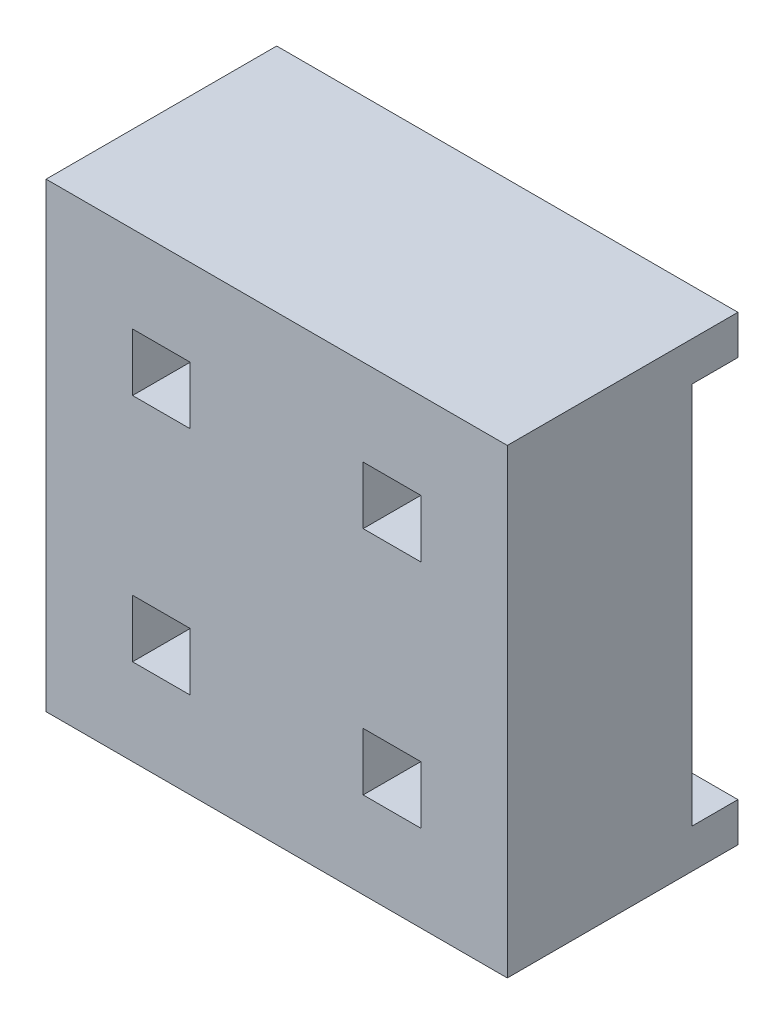
ISO-10303-21;
HEADER;
FILE_DESCRIPTION(('STEP AP214'),'2;1');
FILE_NAME('part.step','',(''),(''),'','','');
FILE_SCHEMA(('AUTOMOTIVE_DESIGN { 1 0 10303 214 1 1 1 1 }'));
ENDSEC;
DATA;
#1=APPLICATION_CONTEXT('core data for automotive mechanical design processes');
#2=APPLICATION_PROTOCOL_DEFINITION('international standard','automotive_design',2000,#1);
#3=PRODUCT_CONTEXT('',#1,'mechanical');
#4=PRODUCT('Part','Part','',(#3));
#5=PRODUCT_RELATED_PRODUCT_CATEGORY('part','',(#4));
#6=PRODUCT_DEFINITION_FORMATION('','',#4);
#7=PRODUCT_DEFINITION_CONTEXT('part definition',#1,'design');
#8=PRODUCT_DEFINITION('design','',#6,#7);
#9=PRODUCT_DEFINITION_SHAPE('','',#8);
#10=(LENGTH_UNIT() NAMED_UNIT(*) SI_UNIT(.MILLI.,.METRE.));
#11=(NAMED_UNIT(*) PLANE_ANGLE_UNIT() SI_UNIT($,.RADIAN.));
#12=(NAMED_UNIT(*) SI_UNIT($,.STERADIAN.) SOLID_ANGLE_UNIT());
#13=UNCERTAINTY_MEASURE_WITH_UNIT(LENGTH_MEASURE(1.E-05),#10,'distance_accuracy_value','');
#14=(GEOMETRIC_REPRESENTATION_CONTEXT(3) GLOBAL_UNCERTAINTY_ASSIGNED_CONTEXT((#13)) GLOBAL_UNIT_ASSIGNED_CONTEXT((#10,
#11,#12)) REPRESENTATION_CONTEXT('',''));
#15=CARTESIAN_POINT('',(0.,0.,0.));
#16=DIRECTION('',(0.,0.,1.));
#17=DIRECTION('',(1.,0.,0.));
#18=AXIS2_PLACEMENT_3D('',#15,#16,#17);
#19=CARTESIAN_POINT('',(0.000124023441458121,0.000124023441458121,1.25));
#20=DIRECTION('',(0.,-4.37113882867379E-08,1.));
#21=DIRECTION('',(0.,-1.,-4.37113882867379E-08));
#22=AXIS2_PLACEMENT_3D('',#19,#20,#21);
#23=PLANE('',#22);
#24=DIRECTION('',(0.,-0.999999999999999,-4.37113882735736E-08));
#25=VECTOR('',#24,1.);
#26=CARTESIAN_POINT('',(-2.53987597655854,-2.10807597655854,1.24999990784765));
#27=LINE('',#26,#25);
#28=CARTESIAN_POINT('',(-2.53987597655854,-2.10807597655854,1.24999990784765));
#29=VERTEX_POINT('',#28);
#30=CARTESIAN_POINT('',(-2.53987597655854,-2.53987597655854,1.24999988897307));
#31=VERTEX_POINT('',#30);
#32=EDGE_CURVE('E11',#29,#31,#27,.T.);
#33=ORIENTED_EDGE('',*,*,#32,.F.);
#34=DIRECTION('',(1.,0.,0.));
#35=VECTOR('',#34,1.);
#36=CARTESIAN_POINT('',(-2.53987597655854,-2.10807597655854,1.24999990784765));
#37=LINE('',#36,#35);
#38=CARTESIAN_POINT('',(2.54012402344146,-2.10807597655854,1.24999990784765));
#39=VERTEX_POINT('',#38);
#40=EDGE_CURVE('E323',#29,#39,#37,.T.);
#41=ORIENTED_EDGE('',*,*,#40,.T.);
#42=DIRECTION('',(0.,0.999999999999999,4.37113882735736E-08));
#43=VECTOR('',#42,1.);
#44=CARTESIAN_POINT('',(2.54012402344146,-2.53987597655854,1.24999988897307));
#45=LINE('',#44,#43);
#46=CARTESIAN_POINT('',(2.54012402344146,-2.53987597655854,1.24999988897307));
#47=VERTEX_POINT('',#46);
#48=EDGE_CURVE('E316',#47,#39,#45,.T.);
#49=ORIENTED_EDGE('',*,*,#48,.F.);
#50=DIRECTION('',(1.,0.,0.));
#51=VECTOR('',#50,1.);
#52=CARTESIAN_POINT('',(-2.53987597655854,-2.53987597655854,1.24999988897307));
#53=LINE('',#52,#51);
#54=EDGE_CURVE('E321',#31,#47,#53,.T.);
#55=ORIENTED_EDGE('',*,*,#54,.F.);
#56=EDGE_LOOP('',(#33,#41,#49,#55));
#57=FACE_BOUND('',#56,.T.);
#58=ADVANCED_FACE('F17',(#57),#23,.F.);
#59=CARTESIAN_POINT('',(-2.53987597655854,2.54012391241453,3.79000011102693));
#60=DIRECTION('',(1.,0.,0.));
#61=DIRECTION('',(0.,1.,4.37113882867379E-08));
#62=AXIS2_PLACEMENT_3D('',#59,#60,#61);
#63=PLANE('',#62);
#64=DIRECTION('',(0.,-0.999999999999999,-4.37113883231379E-08));
#65=VECTOR('',#64,1.);
#66=CARTESIAN_POINT('',(-2.53987597655854,2.10832400123607,1.75800009215235));
#67=LINE('',#66,#65);
#68=CARTESIAN_POINT('',(-2.53987597655854,2.10832400123607,1.75800009215235));
#69=VERTEX_POINT('',#68);
#70=CARTESIAN_POINT('',(-2.53987597655854,-2.10807599876393,1.75799990784765));
#71=VERTEX_POINT('',#70);
#72=EDGE_CURVE('E24',#69,#71,#67,.T.);
#73=ORIENTED_EDGE('',*,*,#72,.T.);
#74=DIRECTION('',(0.,4.37113888392268E-08,-0.999999999999999));
#75=VECTOR('',#74,1.);
#76=CARTESIAN_POINT('',(-2.53987597655854,-2.10807599876393,1.75799990784765));
#77=LINE('',#76,#75);
#78=EDGE_CURVE('E319',#71,#29,#77,.T.);
#79=ORIENTED_EDGE('',*,*,#78,.T.);
#80=ORIENTED_EDGE('',*,*,#32,.T.);
#81=DIRECTION('',(0.,4.3711388314712E-08,-0.999999999999999));
#82=VECTOR('',#81,1.);
#83=CARTESIAN_POINT('',(-2.53987597655854,-2.53987608758547,3.78999988897307));
#84=LINE('',#83,#82);
#85=CARTESIAN_POINT('',(-2.53987597655854,-2.53987608758547,3.78999988897307));
#86=VERTEX_POINT('',#85);
#87=EDGE_CURVE('E301',#86,#31,#84,.T.);
#88=ORIENTED_EDGE('',*,*,#87,.F.);
#89=DIRECTION('',(0.,-0.999999999999999,-4.37113884895503E-08));
#90=VECTOR('',#89,1.);
#91=CARTESIAN_POINT('',(-2.53987597655854,2.54012391241453,3.79000011102693));
#92=LINE('',#91,#90);
#93=CARTESIAN_POINT('',(-2.53987597655854,2.54012391241453,3.79000011102693));
#94=VERTEX_POINT('',#93);
#95=EDGE_CURVE('E289',#94,#86,#92,.T.);
#96=ORIENTED_EDGE('',*,*,#95,.F.);
#97=DIRECTION('',(0.,4.3711388314712E-08,-0.999999999999999));
#98=VECTOR('',#97,1.);
#99=CARTESIAN_POINT('',(-2.53987597655854,2.54012391241453,3.79000011102693));
#100=LINE('',#99,#98);
#101=CARTESIAN_POINT('',(-2.53987597655854,2.54012402344146,1.25000011102693));
#102=VERTEX_POINT('',#101);
#103=EDGE_CURVE('E276',#94,#102,#100,.T.);
#104=ORIENTED_EDGE('',*,*,#103,.T.);
#105=DIRECTION('',(0.,-0.999999999999999,-4.37113882735736E-08));
#106=VECTOR('',#105,1.);
#107=CARTESIAN_POINT('',(-2.53987597655854,2.54012402344146,1.25000011102693));
#108=LINE('',#107,#106);
#109=CARTESIAN_POINT('',(-2.53987597655854,2.10832402344146,1.25000009215235));
#110=VERTEX_POINT('',#109);
#111=EDGE_CURVE('E261',#102,#110,#108,.T.);
#112=ORIENTED_EDGE('',*,*,#111,.T.);
#113=DIRECTION('',(0.,-4.37113879650355E-08,0.999999999999999));
#114=VECTOR('',#113,1.);
#115=CARTESIAN_POINT('',(-2.53987597655854,2.10832402344146,1.25000009215235));
#116=LINE('',#115,#114);
#117=EDGE_CURVE('E247',#110,#69,#116,.T.);
#118=ORIENTED_EDGE('',*,*,#117,.T.);
#119=EDGE_LOOP('',(#73,#79,#80,#88,#96,#104,#112,#118));
#120=FACE_BOUND('',#119,.T.);
#121=ADVANCED_FACE('F416',(#120),#63,.F.);
#122=CARTESIAN_POINT('',(-2.53987597655854,-2.53987608758547,3.78999988897307));
#123=DIRECTION('',(0.,1.,4.37113882867379E-08));
#124=DIRECTION('',(-1.,0.,0.));
#125=AXIS2_PLACEMENT_3D('',#122,#123,#124);
#126=PLANE('',#125);
#127=ORIENTED_EDGE('',*,*,#54,.T.);
#128=DIRECTION('',(0.,4.3711388314712E-08,-0.999999999999999));
#129=VECTOR('',#128,1.);
#130=CARTESIAN_POINT('',(2.54012402344146,-2.53987608758547,3.78999988897307));
#131=LINE('',#130,#129);
#132=CARTESIAN_POINT('',(2.54012402344146,-2.53987608758547,3.78999988897307));
#133=VERTEX_POINT('',#132);
#134=EDGE_CURVE('E313',#133,#47,#131,.T.);
#135=ORIENTED_EDGE('',*,*,#134,.F.);
#136=DIRECTION('',(1.,0.,0.));
#137=VECTOR('',#136,1.);
#138=CARTESIAN_POINT('',(-2.53987597655854,-2.53987608758547,3.78999988897307));
#139=LINE('',#138,#137);
#140=EDGE_CURVE('E304',#86,#133,#139,.T.);
#141=ORIENTED_EDGE('',*,*,#140,.F.);
#142=ORIENTED_EDGE('',*,*,#87,.T.);
#143=EDGE_LOOP('',(#127,#135,#141,#142));
#144=FACE_BOUND('',#143,.T.);
#145=ADVANCED_FACE('F420',(#144),#126,.F.);
#146=CARTESIAN_POINT('',(2.54012402344146,-2.53987608758547,3.78999988897307));
#147=DIRECTION('',(-1.,0.,0.));
#148=DIRECTION('',(0.,-1.,-4.37113882867379E-08));
#149=AXIS2_PLACEMENT_3D('',#146,#147,#148);
#150=PLANE('',#149);
#151=ORIENTED_EDGE('',*,*,#48,.T.);
#152=DIRECTION('',(0.,4.37113888392268E-08,-0.999999999999999));
#153=VECTOR('',#152,1.);
#154=CARTESIAN_POINT('',(2.54012402344146,-2.10807599876393,1.75799990784765));
#155=LINE('',#154,#153);
#156=CARTESIAN_POINT('',(2.54012402344146,-2.10807599876393,1.75799990784765));
#157=VERTEX_POINT('',#156);
#158=EDGE_CURVE('E307',#157,#39,#155,.T.);
#159=ORIENTED_EDGE('',*,*,#158,.F.);
#160=DIRECTION('',(0.,-0.999999999999999,-4.37113883231379E-08));
#161=VECTOR('',#160,1.);
#162=CARTESIAN_POINT('',(2.54012402344146,2.10832400123607,1.75800009215235));
#163=LINE('',#162,#161);
#164=CARTESIAN_POINT('',(2.54012402344146,2.10832400123607,1.75800009215235));
#165=VERTEX_POINT('',#164);
#166=EDGE_CURVE('E292',#165,#157,#163,.T.);
#167=ORIENTED_EDGE('',*,*,#166,.F.);
#168=DIRECTION('',(0.,-4.37113879650355E-08,0.999999999999999));
#169=VECTOR('',#168,1.);
#170=CARTESIAN_POINT('',(2.54012402344146,2.10832402344146,1.25000009215235));
#171=LINE('',#170,#169);
#172=CARTESIAN_POINT('',(2.54012402344146,2.10832402344146,1.25000009215235));
#173=VERTEX_POINT('',#172);
#174=EDGE_CURVE('E278',#173,#165,#171,.T.);
#175=ORIENTED_EDGE('',*,*,#174,.F.);
#176=DIRECTION('',(0.,0.999999999999999,4.37113882735736E-08));
#177=VECTOR('',#176,1.);
#178=CARTESIAN_POINT('',(2.54012402344146,2.10832402344146,1.25000009215235));
#179=LINE('',#178,#177);
#180=CARTESIAN_POINT('',(2.54012402344146,2.54012402344146,1.25000011102693));
#181=VERTEX_POINT('',#180);
#182=EDGE_CURVE('E263',#173,#181,#179,.T.);
#183=ORIENTED_EDGE('',*,*,#182,.T.);
#184=DIRECTION('',(0.,4.3711388314712E-08,-0.999999999999999));
#185=VECTOR('',#184,1.);
#186=CARTESIAN_POINT('',(2.54012402344146,2.54012391241453,3.79000011102693));
#187=LINE('',#186,#185);
#188=CARTESIAN_POINT('',(2.54012402344146,2.54012391241453,3.79000011102693));
#189=VERTEX_POINT('',#188);
#190=EDGE_CURVE('E249',#189,#181,#187,.T.);
#191=ORIENTED_EDGE('',*,*,#190,.F.);
#192=DIRECTION('',(0.,0.999999999999999,4.37113881398737E-08));
#193=VECTOR('',#192,1.);
#194=CARTESIAN_POINT('',(2.54012402344146,-2.53987608758547,3.78999988897307));
#195=LINE('',#194,#193);
#196=EDGE_CURVE('E236',#133,#189,#195,.T.);
#197=ORIENTED_EDGE('',*,*,#196,.F.);
#198=ORIENTED_EDGE('',*,*,#134,.T.);
#199=EDGE_LOOP('',(#151,#159,#167,#175,#183,#191,#197,#198));
#200=FACE_BOUND('',#199,.T.);
#201=ADVANCED_FACE('F329',(#200),#150,.F.);
#202=CARTESIAN_POINT('',(0.952624023441458,1.58762391241453,3.79000006939183));
#203=DIRECTION('',(1.,0.,0.));
#204=DIRECTION('',(0.,1.,4.37113882867379E-08));
#205=AXIS2_PLACEMENT_3D('',#202,#203,#204);
#206=PLANE('',#205);
#207=DIRECTION('',(0.,-0.999999999999999,-4.3711388314712E-08));
#208=VECTOR('',#207,1.);
#209=CARTESIAN_POINT('',(0.952624023441458,1.58762400123607,1.75800006939183));
#210=LINE('',#209,#208);
#211=CARTESIAN_POINT('',(0.952624023441458,1.58762400123607,1.75800006939183));
#212=VERTEX_POINT('',#211);
#213=CARTESIAN_POINT('',(0.952624023441458,0.952624001236073,1.7580000416351));
#214=VERTEX_POINT('',#213);
#215=EDGE_CURVE('E310',#212,#214,#210,.T.);
#216=ORIENTED_EDGE('',*,*,#215,.F.);
#217=DIRECTION('',(0.,4.37113884021311E-08,-0.999999999999999));
#218=VECTOR('',#217,1.);
#219=CARTESIAN_POINT('',(0.952624023441458,1.58762391241453,3.79000006939183));
#220=LINE('',#219,#218);
#221=CARTESIAN_POINT('',(0.952624023441458,1.58762391241453,3.79000006939183));
#222=VERTEX_POINT('',#221);
#223=EDGE_CURVE('E295',#222,#212,#220,.T.);
#224=ORIENTED_EDGE('',*,*,#223,.F.);
#225=DIRECTION('',(0.,-0.999999999999999,-4.3711388314712E-08));
#226=VECTOR('',#225,1.);
#227=CARTESIAN_POINT('',(0.952624023441458,1.58762391241453,3.79000006939183));
#228=LINE('',#227,#226);
#229=CARTESIAN_POINT('',(0.952624023441458,0.952623912414532,3.7900000416351));
#230=VERTEX_POINT('',#229);
#231=EDGE_CURVE('E281',#222,#230,#228,.T.);
#232=ORIENTED_EDGE('',*,*,#231,.T.);
#233=DIRECTION('',(0.,4.37113882928572E-08,-0.999999999999999));
#234=VECTOR('',#233,1.);
#235=CARTESIAN_POINT('',(0.952624023441458,0.952623912414532,3.7900000416351));
#236=LINE('',#235,#234);
#237=EDGE_CURVE('E265',#230,#214,#236,.T.);
#238=ORIENTED_EDGE('',*,*,#237,.T.);
#239=EDGE_LOOP('',(#216,#224,#232,#238));
#240=FACE_BOUND('',#239,.T.);
#241=ADVANCED_FACE('F435',(#240),#206,.T.);
#242=CARTESIAN_POINT('',(1.58762402344146,1.58762391241453,3.79000006939183));
#243=DIRECTION('',(0.,-1.,-4.37113882867379E-08));
#244=DIRECTION('',(1.,0.,0.));
#245=AXIS2_PLACEMENT_3D('',#242,#243,#244);
#246=PLANE('',#245);
#247=DIRECTION('',(-1.,0.,0.));
#248=VECTOR('',#247,1.);
#249=CARTESIAN_POINT('',(1.58762402344146,1.58762400123607,1.75800006939183));
#250=LINE('',#249,#248);
#251=CARTESIAN_POINT('',(1.58762402344146,1.58762400123607,1.75800006939183));
#252=VERTEX_POINT('',#251);
#253=EDGE_CURVE('E298',#252,#212,#250,.T.);
#254=ORIENTED_EDGE('',*,*,#253,.F.);
#255=DIRECTION('',(0.,4.37113884021311E-08,-0.999999999999999));
#256=VECTOR('',#255,1.);
#257=CARTESIAN_POINT('',(1.58762402344146,1.58762391241453,3.79000006939183));
#258=LINE('',#257,#256);
#259=CARTESIAN_POINT('',(1.58762402344146,1.58762391241453,3.79000006939183));
#260=VERTEX_POINT('',#259);
#261=EDGE_CURVE('E283',#260,#252,#258,.T.);
#262=ORIENTED_EDGE('',*,*,#261,.F.);
#263=DIRECTION('',(-1.,0.,0.));
#264=VECTOR('',#263,1.);
#265=CARTESIAN_POINT('',(1.58762402344146,1.58762391241453,3.79000006939183));
#266=LINE('',#265,#264);
#267=EDGE_CURVE('E267',#260,#222,#266,.T.);
#268=ORIENTED_EDGE('',*,*,#267,.T.);
#269=ORIENTED_EDGE('',*,*,#223,.T.);
#270=EDGE_LOOP('',(#254,#262,#268,#269));
#271=FACE_BOUND('',#270,.T.);
#272=ADVANCED_FACE('F438',(#271),#246,.T.);
#273=CARTESIAN_POINT('',(1.58762402344146,0.952623912414532,3.7900000416351));
#274=DIRECTION('',(-1.,0.,0.));
#275=DIRECTION('',(0.,-1.,-4.37113882867379E-08));
#276=AXIS2_PLACEMENT_3D('',#273,#274,#275);
#277=PLANE('',#276);
#278=DIRECTION('',(0.,0.999999999999999,4.3711388314712E-08));
#279=VECTOR('',#278,1.);
#280=CARTESIAN_POINT('',(1.58762402344146,0.952624001236073,1.7580000416351));
#281=LINE('',#280,#279);
#282=CARTESIAN_POINT('',(1.58762402344146,0.952624001236073,1.7580000416351));
#283=VERTEX_POINT('',#282);
#284=EDGE_CURVE('E286',#283,#252,#281,.T.);
#285=ORIENTED_EDGE('',*,*,#284,.F.);
#286=DIRECTION('',(0.,4.37113882928572E-08,-0.999999999999999));
#287=VECTOR('',#286,1.);
#288=CARTESIAN_POINT('',(1.58762402344146,0.952623912414532,3.7900000416351));
#289=LINE('',#288,#287);
#290=CARTESIAN_POINT('',(1.58762402344146,0.952623912414532,3.7900000416351));
#291=VERTEX_POINT('',#290);
#292=EDGE_CURVE('E270',#291,#283,#289,.T.);
#293=ORIENTED_EDGE('',*,*,#292,.F.);
#294=DIRECTION('',(0.,0.999999999999999,4.3711388314712E-08));
#295=VECTOR('',#294,1.);
#296=CARTESIAN_POINT('',(1.58762402344146,0.952623912414532,3.7900000416351));
#297=LINE('',#296,#295);
#298=EDGE_CURVE('E252',#291,#260,#297,.T.);
#299=ORIENTED_EDGE('',*,*,#298,.T.);
#300=ORIENTED_EDGE('',*,*,#261,.T.);
#301=EDGE_LOOP('',(#285,#293,#299,#300));
#302=FACE_BOUND('',#301,.T.);
#303=ADVANCED_FACE('F442',(#302),#277,.T.);
#304=CARTESIAN_POINT('',(0.952624023441458,-0.952376087585468,3.7899999583649));
#305=DIRECTION('',(1.,0.,0.));
#306=DIRECTION('',(0.,1.,4.37113882867379E-08));
#307=AXIS2_PLACEMENT_3D('',#304,#305,#306);
#308=PLANE('',#307);
#309=DIRECTION('',(0.,-0.999999999999999,-4.3711388314712E-08));
#310=VECTOR('',#309,1.);
#311=CARTESIAN_POINT('',(0.952624023441458,-0.952375998763927,1.7579999583649));
#312=LINE('',#311,#310);
#313=CARTESIAN_POINT('',(0.952624023441458,-0.952375998763927,1.7579999583649));
#314=VERTEX_POINT('',#313);
#315=CARTESIAN_POINT('',(0.952624023441458,-1.58737599876393,1.75799993060817));
#316=VERTEX_POINT('',#315);
#317=EDGE_CURVE('E273',#314,#316,#312,.T.);
#318=ORIENTED_EDGE('',*,*,#317,.F.);
#319=DIRECTION('',(0.,4.37113882928572E-08,-0.999999999999999));
#320=VECTOR('',#319,1.);
#321=CARTESIAN_POINT('',(0.952624023441458,-0.952376087585468,3.7899999583649));
#322=LINE('',#321,#320);
#323=CARTESIAN_POINT('',(0.952624023441458,-0.952376087585468,3.7899999583649));
#324=VERTEX_POINT('',#323);
#325=EDGE_CURVE('E255',#324,#314,#322,.T.);
#326=ORIENTED_EDGE('',*,*,#325,.F.);
#327=DIRECTION('',(0.,-0.999999999999999,-4.3711388314712E-08));
#328=VECTOR('',#327,1.);
#329=CARTESIAN_POINT('',(0.952624023441458,-0.952376087585468,3.7899999583649));
#330=LINE('',#329,#328);
#331=CARTESIAN_POINT('',(0.952624023441458,-1.58737608758547,3.78999993060817));
#332=VERTEX_POINT('',#331);
#333=EDGE_CURVE('E239',#324,#332,#330,.T.);
#334=ORIENTED_EDGE('',*,*,#333,.T.);
#335=DIRECTION('',(0.,4.37113881835833E-08,-0.999999999999999));
#336=VECTOR('',#335,1.);
#337=CARTESIAN_POINT('',(0.952624023441458,-1.58737608758547,3.78999993060817));
#338=LINE('',#337,#336);
#339=EDGE_CURVE('E225',#332,#316,#338,.T.);
#340=ORIENTED_EDGE('',*,*,#339,.T.);
#341=EDGE_LOOP('',(#318,#326,#334,#340));
#342=FACE_BOUND('',#341,.T.);
#343=ADVANCED_FACE('F450',(#342),#308,.T.);
#344=CARTESIAN_POINT('',(1.58762402344146,-0.952376087585468,3.7899999583649));
#345=DIRECTION('',(0.,-1.,-4.37113882867379E-08));
#346=DIRECTION('',(1.,0.,0.));
#347=AXIS2_PLACEMENT_3D('',#344,#345,#346);
#348=PLANE('',#347);
#349=DIRECTION('',(-1.,0.,0.));
#350=VECTOR('',#349,1.);
#351=CARTESIAN_POINT('',(1.58762402344146,-0.952375998763927,1.7579999583649));
#352=LINE('',#351,#350);
#353=CARTESIAN_POINT('',(1.58762402344146,-0.952375998763927,1.7579999583649));
#354=VERTEX_POINT('',#353);
#355=EDGE_CURVE('E258',#354,#314,#352,.T.);
#356=ORIENTED_EDGE('',*,*,#355,.F.);
#357=DIRECTION('',(0.,4.37113882928572E-08,-0.999999999999999));
#358=VECTOR('',#357,1.);
#359=CARTESIAN_POINT('',(1.58762402344146,-0.952376087585468,3.7899999583649));
#360=LINE('',#359,#358);
#361=CARTESIAN_POINT('',(1.58762402344146,-0.952376087585468,3.7899999583649));
#362=VERTEX_POINT('',#361);
#363=EDGE_CURVE('E241',#362,#354,#360,.T.);
#364=ORIENTED_EDGE('',*,*,#363,.F.);
#365=DIRECTION('',(-1.,0.,0.));
#366=VECTOR('',#365,1.);
#367=CARTESIAN_POINT('',(1.58762402344146,-0.952376087585468,3.7899999583649));
#368=LINE('',#367,#366);
#369=EDGE_CURVE('E227',#362,#324,#368,.T.);
#370=ORIENTED_EDGE('',*,*,#369,.T.);
#371=ORIENTED_EDGE('',*,*,#325,.T.);
#372=EDGE_LOOP('',(#356,#364,#370,#371));
#373=FACE_BOUND('',#372,.T.);
#374=ADVANCED_FACE('F454',(#373),#348,.T.);
#375=CARTESIAN_POINT('',(1.58762402344146,-1.58737608758547,3.78999993060817));
#376=DIRECTION('',(-1.,0.,0.));
#377=DIRECTION('',(0.,-1.,-4.37113882867379E-08));
#378=AXIS2_PLACEMENT_3D('',#375,#376,#377);
#379=PLANE('',#378);
#380=DIRECTION('',(0.,0.999999999999999,4.3711388314712E-08));
#381=VECTOR('',#380,1.);
#382=CARTESIAN_POINT('',(1.58762402344146,-1.58737599876393,1.75799993060817));
#383=LINE('',#382,#381);
#384=CARTESIAN_POINT('',(1.58762402344146,-1.58737599876393,1.75799993060817));
#385=VERTEX_POINT('',#384);
#386=EDGE_CURVE('E244',#385,#354,#383,.T.);
#387=ORIENTED_EDGE('',*,*,#386,.F.);
#388=DIRECTION('',(0.,4.37113881835833E-08,-0.999999999999999));
#389=VECTOR('',#388,1.);
#390=CARTESIAN_POINT('',(1.58762402344146,-1.58737608758547,3.78999993060817));
#391=LINE('',#390,#389);
#392=CARTESIAN_POINT('',(1.58762402344146,-1.58737608758547,3.78999993060817));
#393=VERTEX_POINT('',#392);
#394=EDGE_CURVE('E230',#393,#385,#391,.T.);
#395=ORIENTED_EDGE('',*,*,#394,.F.);
#396=DIRECTION('',(0.,0.999999999999999,4.3711388314712E-08));
#397=VECTOR('',#396,1.);
#398=CARTESIAN_POINT('',(1.58762402344146,-1.58737608758547,3.78999993060817));
#399=LINE('',#398,#397);
#400=EDGE_CURVE('E216',#393,#362,#399,.T.);
#401=ORIENTED_EDGE('',*,*,#400,.T.);
#402=ORIENTED_EDGE('',*,*,#363,.T.);
#403=EDGE_LOOP('',(#387,#395,#401,#402));
#404=FACE_BOUND('',#403,.T.);
#405=ADVANCED_FACE('F464',(#404),#379,.T.);
#406=CARTESIAN_POINT('',(-1.58737597655854,1.58762391241453,3.79000006939183));
#407=DIRECTION('',(1.,0.,0.));
#408=DIRECTION('',(0.,1.,4.37113882867379E-08));
#409=AXIS2_PLACEMENT_3D('',#406,#407,#408);
#410=PLANE('',#409);
#411=DIRECTION('',(0.,-0.999999999999999,-4.3711388314712E-08));
#412=VECTOR('',#411,1.);
#413=CARTESIAN_POINT('',(-1.58737597655854,1.58762400123607,1.75800006939183));
#414=LINE('',#413,#412);
#415=CARTESIAN_POINT('',(-1.58737597655854,1.58762400123607,1.75800006939183));
#416=VERTEX_POINT('',#415);
#417=CARTESIAN_POINT('',(-1.58737597655854,0.952624001236073,1.7580000416351));
#418=VERTEX_POINT('',#417);
#419=EDGE_CURVE('E233',#416,#418,#414,.T.);
#420=ORIENTED_EDGE('',*,*,#419,.F.);
#421=DIRECTION('',(0.,4.37113884021311E-08,-0.999999999999999));
#422=VECTOR('',#421,1.);
#423=CARTESIAN_POINT('',(-1.58737597655854,1.58762391241453,3.79000006939183));
#424=LINE('',#423,#422);
#425=CARTESIAN_POINT('',(-1.58737597655854,1.58762391241453,3.79000006939183));
#426=VERTEX_POINT('',#425);
#427=EDGE_CURVE('E219',#426,#416,#424,.T.);
#428=ORIENTED_EDGE('',*,*,#427,.F.);
#429=DIRECTION('',(0.,-0.999999999999999,-4.3711388314712E-08));
#430=VECTOR('',#429,1.);
#431=CARTESIAN_POINT('',(-1.58737597655854,1.58762391241453,3.79000006939183));
#432=LINE('',#431,#430);
#433=CARTESIAN_POINT('',(-1.58737597655854,0.952623912414532,3.7900000416351));
#434=VERTEX_POINT('',#433);
#435=EDGE_CURVE('E201',#426,#434,#432,.T.);
#436=ORIENTED_EDGE('',*,*,#435,.T.);
#437=DIRECTION('',(0.,4.37113882928572E-08,-0.999999999999999));
#438=VECTOR('',#437,1.);
#439=CARTESIAN_POINT('',(-1.58737597655854,0.952623912414532,3.7900000416351));
#440=LINE('',#439,#438);
#441=EDGE_CURVE('E384',#434,#418,#440,.T.);
#442=ORIENTED_EDGE('',*,*,#441,.T.);
#443=EDGE_LOOP('',(#420,#428,#436,#442));
#444=FACE_BOUND('',#443,.T.);
#445=ADVANCED_FACE('F397',(#444),#410,.T.);
#446=CARTESIAN_POINT('',(-0.952375976558542,1.58762391241453,3.79000006939183));
#447=DIRECTION('',(0.,-1.,-4.37113882867379E-08));
#448=DIRECTION('',(1.,0.,0.));
#449=AXIS2_PLACEMENT_3D('',#446,#447,#448);
#450=PLANE('',#449);
#451=DIRECTION('',(-1.,0.,0.));
#452=VECTOR('',#451,1.);
#453=CARTESIAN_POINT('',(-0.952375976558542,1.58762400123607,1.75800006939183));
#454=LINE('',#453,#452);
#455=CARTESIAN_POINT('',(-0.952375976558542,1.58762400123607,1.75800006939183));
#456=VERTEX_POINT('',#455);
#457=EDGE_CURVE('E222',#456,#416,#454,.T.);
#458=ORIENTED_EDGE('',*,*,#457,.F.);
#459=DIRECTION('',(0.,4.37113884021311E-08,-0.999999999999999));
#460=VECTOR('',#459,1.);
#461=CARTESIAN_POINT('',(-0.952375976558542,1.58762391241453,3.79000006939183));
#462=LINE('',#461,#460);
#463=CARTESIAN_POINT('',(-0.952375976558542,1.58762391241453,3.79000006939183));
#464=VERTEX_POINT('',#463);
#465=EDGE_CURVE('E204',#464,#456,#462,.T.);
#466=ORIENTED_EDGE('',*,*,#465,.F.);
#467=DIRECTION('',(-1.,0.,0.));
#468=VECTOR('',#467,1.);
#469=CARTESIAN_POINT('',(-0.952375976558542,1.58762391241453,3.79000006939183));
#470=LINE('',#469,#468);
#471=EDGE_CURVE('E207',#464,#426,#470,.T.);
#472=ORIENTED_EDGE('',*,*,#471,.T.);
#473=ORIENTED_EDGE('',*,*,#427,.T.);
#474=EDGE_LOOP('',(#458,#466,#472,#473));
#475=FACE_BOUND('',#474,.T.);
#476=ADVANCED_FACE('F389',(#475),#450,.T.);
#477=CARTESIAN_POINT('',(-0.952375976558542,0.952623912414532,3.7900000416351));
#478=DIRECTION('',(-1.,0.,0.));
#479=DIRECTION('',(0.,-1.,-4.37113882867379E-08));
#480=AXIS2_PLACEMENT_3D('',#477,#478,#479);
#481=PLANE('',#480);
#482=DIRECTION('',(0.,0.999999999999999,4.3711388314712E-08));
#483=VECTOR('',#482,1.);
#484=CARTESIAN_POINT('',(-0.952375976558542,0.952624001236073,1.7580000416351));
#485=LINE('',#484,#483);
#486=CARTESIAN_POINT('',(-0.952375976558542,0.952624001236073,1.7580000416351));
#487=VERTEX_POINT('',#486);
#488=EDGE_CURVE('E213',#487,#456,#485,.T.);
#489=ORIENTED_EDGE('',*,*,#488,.F.);
#490=DIRECTION('',(0.,4.37113882928572E-08,-0.999999999999999));
#491=VECTOR('',#490,1.);
#492=CARTESIAN_POINT('',(-0.952375976558542,0.952623912414532,3.7900000416351));
#493=LINE('',#492,#491);
#494=CARTESIAN_POINT('',(-0.952375976558542,0.952623912414532,3.7900000416351));
#495=VERTEX_POINT('',#494);
#496=EDGE_CURVE('E202',#495,#487,#493,.T.);
#497=ORIENTED_EDGE('',*,*,#496,.F.);
#498=DIRECTION('',(0.,0.999999999999999,4.3711388314712E-08));
#499=VECTOR('',#498,1.);
#500=CARTESIAN_POINT('',(-0.952375976558542,0.952623912414532,3.7900000416351));
#501=LINE('',#500,#499);
#502=EDGE_CURVE('E378',#495,#464,#501,.T.);
#503=ORIENTED_EDGE('',*,*,#502,.T.);
#504=ORIENTED_EDGE('',*,*,#465,.T.);
#505=EDGE_LOOP('',(#489,#497,#503,#504));
#506=FACE_BOUND('',#505,.T.);
#507=ADVANCED_FACE('F403',(#506),#481,.T.);
#508=CARTESIAN_POINT('',(-1.58737597655854,-0.952376087585468,3.7899999583649));
#509=DIRECTION('',(1.,0.,0.));
#510=DIRECTION('',(0.,1.,4.37113882867379E-08));
#511=AXIS2_PLACEMENT_3D('',#508,#509,#510);
#512=PLANE('',#511);
#513=DIRECTION('',(0.,-0.999999999999999,-4.3711388314712E-08));
#514=VECTOR('',#513,1.);
#515=CARTESIAN_POINT('',(-1.58737597655854,-0.952375998763927,1.7579999583649));
#516=LINE('',#515,#514);
#517=CARTESIAN_POINT('',(-1.58737597655854,-0.952375998763927,1.7579999583649));
#518=VERTEX_POINT('',#517);
#519=CARTESIAN_POINT('',(-1.58737597655854,-1.58737599876393,1.75799993060817));
#520=VERTEX_POINT('',#519);
#521=EDGE_CURVE('E177',#518,#520,#516,.T.);
#522=ORIENTED_EDGE('',*,*,#521,.F.);
#523=DIRECTION('',(0.,4.37113882928572E-08,-0.999999999999999));
#524=VECTOR('',#523,1.);
#525=CARTESIAN_POINT('',(-1.58737597655854,-0.952376087585468,3.7899999583649));
#526=LINE('',#525,#524);
#527=CARTESIAN_POINT('',(-1.58737597655854,-0.952376087585468,3.7899999583649));
#528=VERTEX_POINT('',#527);
#529=EDGE_CURVE('E381',#528,#518,#526,.T.);
#530=ORIENTED_EDGE('',*,*,#529,.F.);
#531=DIRECTION('',(0.,-0.999999999999999,-4.3711388314712E-08));
#532=VECTOR('',#531,1.);
#533=CARTESIAN_POINT('',(-1.58737597655854,-0.952376087585468,3.7899999583649));
#534=LINE('',#533,#532);
#535=CARTESIAN_POINT('',(-1.58737597655854,-1.58737608758547,3.78999993060817));
#536=VERTEX_POINT('',#535);
#537=EDGE_CURVE('E180',#528,#536,#534,.T.);
#538=ORIENTED_EDGE('',*,*,#537,.T.);
#539=DIRECTION('',(0.,4.37113881835833E-08,-0.999999999999999));
#540=VECTOR('',#539,1.);
#541=CARTESIAN_POINT('',(-1.58737597655854,-1.58737608758547,3.78999993060817));
#542=LINE('',#541,#540);
#543=EDGE_CURVE('E173',#536,#520,#542,.T.);
#544=ORIENTED_EDGE('',*,*,#543,.T.);
#545=EDGE_LOOP('',(#522,#530,#538,#544));
#546=FACE_BOUND('',#545,.T.);
#547=ADVANCED_FACE('F175',(#546),#512,.T.);
#548=CARTESIAN_POINT('',(-0.952375976558542,-0.952376087585468,3.7899999583649));
#549=DIRECTION('',(0.,-1.,-4.37113882867379E-08));
#550=DIRECTION('',(1.,0.,0.));
#551=AXIS2_PLACEMENT_3D('',#548,#549,#550);
#552=PLANE('',#551);
#553=DIRECTION('',(-1.,0.,0.));
#554=VECTOR('',#553,1.);
#555=CARTESIAN_POINT('',(-0.952375976558542,-0.952375998763927,1.7579999583649));
#556=LINE('',#555,#554);
#557=CARTESIAN_POINT('',(-0.952375976558542,-0.952375998763927,1.7579999583649));
#558=VERTEX_POINT('',#557);
#559=EDGE_CURVE('E200',#558,#518,#556,.T.);
#560=ORIENTED_EDGE('',*,*,#559,.F.);
#561=DIRECTION('',(0.,4.37113882928572E-08,-0.999999999999999));
#562=VECTOR('',#561,1.);
#563=CARTESIAN_POINT('',(-0.952375976558542,-0.952376087585468,3.7899999583649));
#564=LINE('',#563,#562);
#565=CARTESIAN_POINT('',(-0.952375976558542,-0.952376087585468,3.7899999583649));
#566=VERTEX_POINT('',#565);
#567=EDGE_CURVE('E373',#566,#558,#564,.T.);
#568=ORIENTED_EDGE('',*,*,#567,.F.);
#569=DIRECTION('',(-1.,0.,0.));
#570=VECTOR('',#569,1.);
#571=CARTESIAN_POINT('',(-0.952375976558542,-0.952376087585468,3.7899999583649));
#572=LINE('',#571,#570);
#573=EDGE_CURVE('E184',#566,#528,#572,.T.);
#574=ORIENTED_EDGE('',*,*,#573,.T.);
#575=ORIENTED_EDGE('',*,*,#529,.T.);
#576=EDGE_LOOP('',(#560,#568,#574,#575));
#577=FACE_BOUND('',#576,.T.);
#578=ADVANCED_FACE('F411',(#577),#552,.T.);
#579=CARTESIAN_POINT('',(-0.952375976558542,-1.58737608758547,3.78999993060817));
#580=DIRECTION('',(-1.,0.,0.));
#581=DIRECTION('',(0.,-1.,-4.37113882867379E-08));
#582=AXIS2_PLACEMENT_3D('',#579,#580,#581);
#583=PLANE('',#582);
#584=DIRECTION('',(0.,0.999999999999999,4.3711388314712E-08));
#585=VECTOR('',#584,1.);
#586=CARTESIAN_POINT('',(-0.952375976558542,-1.58737599876393,1.75799993060817));
#587=LINE('',#586,#585);
#588=CARTESIAN_POINT('',(-0.952375976558542,-1.58737599876393,1.75799993060817));
#589=VERTEX_POINT('',#588);
#590=EDGE_CURVE('E376',#589,#558,#587,.T.);
#591=ORIENTED_EDGE('',*,*,#590,.F.);
#592=DIRECTION('',(0.,4.37113881835833E-08,-0.999999999999999));
#593=VECTOR('',#592,1.);
#594=CARTESIAN_POINT('',(-0.952375976558542,-1.58737608758547,3.78999993060817));
#595=LINE('',#594,#593);
#596=CARTESIAN_POINT('',(-0.952375976558542,-1.58737608758547,3.78999993060817));
#597=VERTEX_POINT('',#596);
#598=EDGE_CURVE('E191',#597,#589,#595,.T.);
#599=ORIENTED_EDGE('',*,*,#598,.F.);
#600=DIRECTION('',(0.,0.999999999999999,4.3711388314712E-08));
#601=VECTOR('',#600,1.);
#602=CARTESIAN_POINT('',(-0.952375976558542,-1.58737608758547,3.78999993060817));
#603=LINE('',#602,#601);
#604=EDGE_CURVE('E361',#597,#566,#603,.T.);
#605=ORIENTED_EDGE('',*,*,#604,.T.);
#606=ORIENTED_EDGE('',*,*,#567,.T.);
#607=EDGE_LOOP('',(#591,#599,#605,#606));
#608=FACE_BOUND('',#607,.T.);
#609=ADVANCED_FACE('F470',(#608),#583,.T.);
#610=CARTESIAN_POINT('',(0.952624023441458,0.952623912414532,3.7900000416351));
#611=DIRECTION('',(0.,1.,4.37113882867379E-08));
#612=DIRECTION('',(-1.,0.,0.));
#613=AXIS2_PLACEMENT_3D('',#610,#611,#612);
#614=PLANE('',#613);
#615=DIRECTION('',(1.,0.,0.));
#616=VECTOR('',#615,1.);
#617=CARTESIAN_POINT('',(0.952624023441458,0.952624001236073,1.7580000416351));
#618=LINE('',#617,#616);
#619=EDGE_CURVE('E369',#214,#283,#618,.T.);
#620=ORIENTED_EDGE('',*,*,#619,.F.);
#621=ORIENTED_EDGE('',*,*,#237,.F.);
#622=DIRECTION('',(1.,0.,0.));
#623=VECTOR('',#622,1.);
#624=CARTESIAN_POINT('',(0.952624023441458,0.952623912414532,3.7900000416351));
#625=LINE('',#624,#623);
#626=EDGE_CURVE('E194',#230,#291,#625,.T.);
#627=ORIENTED_EDGE('',*,*,#626,.T.);
#628=ORIENTED_EDGE('',*,*,#292,.T.);
#629=EDGE_LOOP('',(#620,#621,#627,#628));
#630=FACE_BOUND('',#629,.T.);
#631=ADVANCED_FACE('F466',(#630),#614,.T.);
#632=CARTESIAN_POINT('',(0.952624023441458,-1.58737608758547,3.78999993060817));
#633=DIRECTION('',(0.,1.,4.37113882867379E-08));
#634=DIRECTION('',(-1.,0.,0.));
#635=AXIS2_PLACEMENT_3D('',#632,#633,#634);
#636=PLANE('',#635);
#637=DIRECTION('',(1.,0.,0.));
#638=VECTOR('',#637,1.);
#639=CARTESIAN_POINT('',(0.952624023441458,-1.58737599876393,1.75799993060817));
#640=LINE('',#639,#638);
#641=EDGE_CURVE('E185',#316,#385,#640,.T.);
#642=ORIENTED_EDGE('',*,*,#641,.F.);
#643=ORIENTED_EDGE('',*,*,#339,.F.);
#644=DIRECTION('',(1.,0.,0.));
#645=VECTOR('',#644,1.);
#646=CARTESIAN_POINT('',(0.952624023441458,-1.58737608758547,3.78999993060817));
#647=LINE('',#646,#645);
#648=EDGE_CURVE('E195',#332,#393,#647,.T.);
#649=ORIENTED_EDGE('',*,*,#648,.T.);
#650=ORIENTED_EDGE('',*,*,#394,.T.);
#651=EDGE_LOOP('',(#642,#643,#649,#650));
#652=FACE_BOUND('',#651,.T.);
#653=ADVANCED_FACE('F469',(#652),#636,.T.);
#654=CARTESIAN_POINT('',(-1.58737597655854,0.952623912414532,3.7900000416351));
#655=DIRECTION('',(0.,1.,4.37113882867379E-08));
#656=DIRECTION('',(-1.,0.,0.));
#657=AXIS2_PLACEMENT_3D('',#654,#655,#656);
#658=PLANE('',#657);
#659=DIRECTION('',(1.,0.,0.));
#660=VECTOR('',#659,1.);
#661=CARTESIAN_POINT('',(-1.58737597655854,0.952624001236073,1.7580000416351));
#662=LINE('',#661,#660);
#663=EDGE_CURVE('E358',#418,#487,#662,.T.);
#664=ORIENTED_EDGE('',*,*,#663,.F.);
#665=ORIENTED_EDGE('',*,*,#441,.F.);
#666=DIRECTION('',(1.,0.,0.));
#667=VECTOR('',#666,1.);
#668=CARTESIAN_POINT('',(-1.58737597655854,0.952623912414532,3.7900000416351));
#669=LINE('',#668,#667);
#670=EDGE_CURVE('E348',#434,#495,#669,.T.);
#671=ORIENTED_EDGE('',*,*,#670,.T.);
#672=ORIENTED_EDGE('',*,*,#496,.T.);
#673=EDGE_LOOP('',(#664,#665,#671,#672));
#674=FACE_BOUND('',#673,.T.);
#675=ADVANCED_FACE('F400',(#674),#658,.T.);
#676=CARTESIAN_POINT('',(-1.58737597655854,-1.58737608758547,3.78999993060817));
#677=DIRECTION('',(0.,1.,4.37113882867379E-08));
#678=DIRECTION('',(-1.,0.,0.));
#679=AXIS2_PLACEMENT_3D('',#676,#677,#678);
#680=PLANE('',#679);
#681=DIRECTION('',(1.,0.,0.));
#682=VECTOR('',#681,1.);
#683=CARTESIAN_POINT('',(-1.58737597655854,-1.58737599876393,1.75799993060817));
#684=LINE('',#683,#682);
#685=EDGE_CURVE('E189',#520,#589,#684,.T.);
#686=ORIENTED_EDGE('',*,*,#685,.F.);
#687=ORIENTED_EDGE('',*,*,#543,.F.);
#688=DIRECTION('',(1.,0.,0.));
#689=VECTOR('',#688,1.);
#690=CARTESIAN_POINT('',(-1.58737597655854,-1.58737608758547,3.78999993060817));
#691=LINE('',#690,#689);
#692=EDGE_CURVE('E346',#536,#597,#691,.T.);
#693=ORIENTED_EDGE('',*,*,#692,.T.);
#694=ORIENTED_EDGE('',*,*,#598,.T.);
#695=EDGE_LOOP('',(#686,#687,#693,#694));
#696=FACE_BOUND('',#695,.T.);
#697=ADVANCED_FACE('F190',(#696),#680,.T.);
#698=CARTESIAN_POINT('',(2.54012402344146,2.54012391241453,3.79000011102693));
#699=DIRECTION('',(0.,-1.,-4.37113882867379E-08));
#700=DIRECTION('',(1.,0.,0.));
#701=AXIS2_PLACEMENT_3D('',#698,#699,#700);
#702=PLANE('',#701);
#703=DIRECTION('',(-1.,0.,0.));
#704=VECTOR('',#703,1.);
#705=CARTESIAN_POINT('',(2.54012402344146,2.54012402344146,1.25000011102693));
#706=LINE('',#705,#704);
#707=EDGE_CURVE('E351',#181,#102,#706,.T.);
#708=ORIENTED_EDGE('',*,*,#707,.T.);
#709=ORIENTED_EDGE('',*,*,#103,.F.);
#710=DIRECTION('',(-1.,0.,0.));
#711=VECTOR('',#710,1.);
#712=CARTESIAN_POINT('',(2.54012402344146,2.54012391241453,3.79000011102693));
#713=LINE('',#712,#711);
#714=EDGE_CURVE('E339',#189,#94,#713,.T.);
#715=ORIENTED_EDGE('',*,*,#714,.F.);
#716=ORIENTED_EDGE('',*,*,#190,.T.);
#717=EDGE_LOOP('',(#708,#709,#715,#716));
#718=FACE_BOUND('',#717,.T.);
#719=ADVANCED_FACE('F446',(#718),#702,.F.);
#720=CARTESIAN_POINT('',(0.000124023441458121,0.000123912414531873,3.79));
#721=DIRECTION('',(0.,-4.37113882867379E-08,1.));
#722=DIRECTION('',(0.,-1.,-4.37113882867379E-08));
#723=AXIS2_PLACEMENT_3D('',#720,#721,#722);
#724=PLANE('',#723);
#725=ORIENTED_EDGE('',*,*,#95,.T.);
#726=ORIENTED_EDGE('',*,*,#140,.T.);
#727=ORIENTED_EDGE('',*,*,#196,.T.);
#728=ORIENTED_EDGE('',*,*,#714,.T.);
#729=EDGE_LOOP('',(#725,#726,#727,#728));
#730=FACE_BOUND('',#729,.T.);
#731=ORIENTED_EDGE('',*,*,#435,.F.);
#732=ORIENTED_EDGE('',*,*,#471,.F.);
#733=ORIENTED_EDGE('',*,*,#502,.F.);
#734=ORIENTED_EDGE('',*,*,#670,.F.);
#735=EDGE_LOOP('',(#731,#732,#733,#734));
#736=FACE_BOUND('',#735,.T.);
#737=ORIENTED_EDGE('',*,*,#333,.F.);
#738=ORIENTED_EDGE('',*,*,#369,.F.);
#739=ORIENTED_EDGE('',*,*,#400,.F.);
#740=ORIENTED_EDGE('',*,*,#648,.F.);
#741=EDGE_LOOP('',(#737,#738,#739,#740));
#742=FACE_BOUND('',#741,.T.);
#743=ORIENTED_EDGE('',*,*,#231,.F.);
#744=ORIENTED_EDGE('',*,*,#267,.F.);
#745=ORIENTED_EDGE('',*,*,#298,.F.);
#746=ORIENTED_EDGE('',*,*,#626,.F.);
#747=EDGE_LOOP('',(#743,#744,#745,#746));
#748=FACE_BOUND('',#747,.T.);
#749=ORIENTED_EDGE('',*,*,#537,.F.);
#750=ORIENTED_EDGE('',*,*,#573,.F.);
#751=ORIENTED_EDGE('',*,*,#604,.F.);
#752=ORIENTED_EDGE('',*,*,#692,.F.);
#753=EDGE_LOOP('',(#749,#750,#751,#752));
#754=FACE_BOUND('',#753,.T.);
#755=ADVANCED_FACE('F393',(#730,#736,#742,#748,#754),#724,.T.);
#756=CARTESIAN_POINT('',(0.000124023441458121,0.000124023441458121,1.25));
#757=DIRECTION('',(0.,-4.37113882867379E-08,1.));
#758=DIRECTION('',(0.,-1.,-4.37113882867379E-08));
#759=AXIS2_PLACEMENT_3D('',#756,#757,#758);
#760=PLANE('',#759);
#761=ORIENTED_EDGE('',*,*,#182,.F.);
#762=DIRECTION('',(1.,0.,0.));
#763=VECTOR('',#762,1.);
#764=CARTESIAN_POINT('',(-2.53987597655854,2.10832402344146,1.25000009215235));
#765=LINE('',#764,#763);
#766=EDGE_CURVE('E335',#110,#173,#765,.T.);
#767=ORIENTED_EDGE('',*,*,#766,.F.);
#768=ORIENTED_EDGE('',*,*,#111,.F.);
#769=ORIENTED_EDGE('',*,*,#707,.F.);
#770=EDGE_LOOP('',(#761,#767,#768,#769));
#771=FACE_BOUND('',#770,.T.);
#772=ADVANCED_FACE('F429',(#771),#760,.F.);
#773=CARTESIAN_POINT('',(-2.53987597655854,2.10832400123607,1.75800009215235));
#774=DIRECTION('',(0.,-4.37113882867379E-08,1.));
#775=DIRECTION('',(0.,-1.,-4.37113882867379E-08));
#776=AXIS2_PLACEMENT_3D('',#773,#774,#775);
#777=PLANE('',#776);
#778=ORIENTED_EDGE('',*,*,#166,.T.);
#779=DIRECTION('',(1.,0.,0.));
#780=VECTOR('',#779,1.);
#781=CARTESIAN_POINT('',(-2.53987597655854,-2.10807599876393,1.75799990784765));
#782=LINE('',#781,#780);
#783=EDGE_CURVE('E333',#71,#157,#782,.T.);
#784=ORIENTED_EDGE('',*,*,#783,.F.);
#785=ORIENTED_EDGE('',*,*,#72,.F.);
#786=DIRECTION('',(1.,0.,0.));
#787=VECTOR('',#786,1.);
#788=CARTESIAN_POINT('',(-2.53987597655854,2.10832400123607,1.75800009215235));
#789=LINE('',#788,#787);
#790=EDGE_CURVE('E336',#69,#165,#789,.T.);
#791=ORIENTED_EDGE('',*,*,#790,.T.);
#792=EDGE_LOOP('',(#778,#784,#785,#791));
#793=FACE_BOUND('',#792,.T.);
#794=ORIENTED_EDGE('',*,*,#317,.T.);
#795=ORIENTED_EDGE('',*,*,#641,.T.);
#796=ORIENTED_EDGE('',*,*,#386,.T.);
#797=ORIENTED_EDGE('',*,*,#355,.T.);
#798=EDGE_LOOP('',(#794,#795,#796,#797));
#799=FACE_BOUND('',#798,.T.);
#800=ORIENTED_EDGE('',*,*,#419,.T.);
#801=ORIENTED_EDGE('',*,*,#663,.T.);
#802=ORIENTED_EDGE('',*,*,#488,.T.);
#803=ORIENTED_EDGE('',*,*,#457,.T.);
#804=EDGE_LOOP('',(#800,#801,#802,#803));
#805=FACE_BOUND('',#804,.T.);
#806=ORIENTED_EDGE('',*,*,#521,.T.);
#807=ORIENTED_EDGE('',*,*,#685,.T.);
#808=ORIENTED_EDGE('',*,*,#590,.T.);
#809=ORIENTED_EDGE('',*,*,#559,.T.);
#810=EDGE_LOOP('',(#806,#807,#808,#809));
#811=FACE_BOUND('',#810,.T.);
#812=ORIENTED_EDGE('',*,*,#215,.T.);
#813=ORIENTED_EDGE('',*,*,#619,.T.);
#814=ORIENTED_EDGE('',*,*,#284,.T.);
#815=ORIENTED_EDGE('',*,*,#253,.T.);
#816=EDGE_LOOP('',(#812,#813,#814,#815));
#817=FACE_BOUND('',#816,.T.);
#818=ADVANCED_FACE('F198',(#793,#799,#805,#811,#817),#777,.F.);
#819=CARTESIAN_POINT('',(-2.53987597655854,-2.10807599876393,1.75799990784765));
#820=DIRECTION('',(0.,-1.,-4.37113891404404E-08));
#821=DIRECTION('',(0.,4.37113891404404E-08,-1.));
#822=AXIS2_PLACEMENT_3D('',#819,#820,#821);
#823=PLANE('',#822);
#824=ORIENTED_EDGE('',*,*,#158,.T.);
#825=ORIENTED_EDGE('',*,*,#40,.F.);
#826=ORIENTED_EDGE('',*,*,#78,.F.);
#827=ORIENTED_EDGE('',*,*,#783,.T.);
#828=EDGE_LOOP('',(#824,#825,#826,#827));
#829=FACE_BOUND('',#828,.T.);
#830=ADVANCED_FACE('F332',(#829),#823,.F.);
#831=CARTESIAN_POINT('',(-2.53987597655854,2.10832402344146,1.25000009215235));
#832=DIRECTION('',(0.,1.,4.37113882867379E-08));
#833=DIRECTION('',(-1.,0.,0.));
#834=AXIS2_PLACEMENT_3D('',#831,#832,#833);
#835=PLANE('',#834);
#836=ORIENTED_EDGE('',*,*,#174,.T.);
#837=ORIENTED_EDGE('',*,*,#790,.F.);
#838=ORIENTED_EDGE('',*,*,#117,.F.);
#839=ORIENTED_EDGE('',*,*,#766,.T.);
#840=EDGE_LOOP('',(#836,#837,#838,#839));
#841=FACE_BOUND('',#840,.T.);
#842=ADVANCED_FACE('F432',(#841),#835,.F.);
#843=CLOSED_SHELL('',(#58,#121,#145,#201,#241,#272,#303,#343,#374,#405,#445,#476,#507,#547,#578,
#609,#631,#653,#675,#697,#719,#755,#772,#818,#830,#842));
#844=MANIFOLD_SOLID_BREP('B1',#843);
#845=ADVANCED_BREP_SHAPE_REPRESENTATION('',(#18,#844),#14);
#846=SHAPE_DEFINITION_REPRESENTATION(#9,#845);
ENDSEC;
END-ISO-10303-21;
